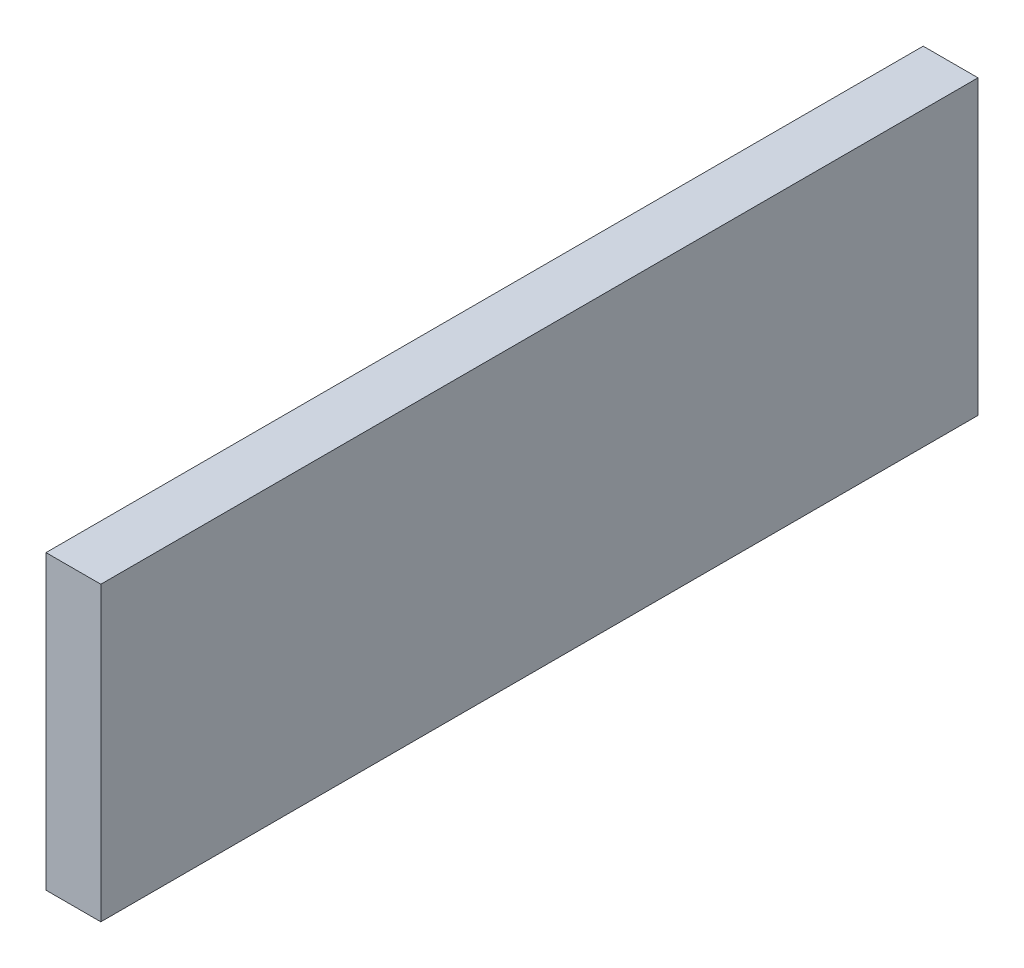
ISO-10303-21;
HEADER;
FILE_DESCRIPTION(('STEP AP214'),'2;1');
FILE_NAME('part.step','',(''),(''),'','','');
FILE_SCHEMA(('AUTOMOTIVE_DESIGN { 1 0 10303 214 1 1 1 1 }'));
ENDSEC;
DATA;
#1=APPLICATION_CONTEXT('core data for automotive mechanical design processes');
#2=APPLICATION_PROTOCOL_DEFINITION('international standard','automotive_design',2000,#1);
#3=PRODUCT_CONTEXT('',#1,'mechanical');
#4=PRODUCT('Part','Part','',(#3));
#5=PRODUCT_RELATED_PRODUCT_CATEGORY('part','',(#4));
#6=PRODUCT_DEFINITION_FORMATION('','',#4);
#7=PRODUCT_DEFINITION_CONTEXT('part definition',#1,'design');
#8=PRODUCT_DEFINITION('design','',#6,#7);
#9=PRODUCT_DEFINITION_SHAPE('','',#8);
#10=(LENGTH_UNIT() NAMED_UNIT(*) SI_UNIT(.MILLI.,.METRE.));
#11=(NAMED_UNIT(*) PLANE_ANGLE_UNIT() SI_UNIT($,.RADIAN.));
#12=(NAMED_UNIT(*) SI_UNIT($,.STERADIAN.) SOLID_ANGLE_UNIT());
#13=UNCERTAINTY_MEASURE_WITH_UNIT(LENGTH_MEASURE(1.E-05),#10,'distance_accuracy_value','');
#14=(GEOMETRIC_REPRESENTATION_CONTEXT(3) GLOBAL_UNCERTAINTY_ASSIGNED_CONTEXT((#13)) GLOBAL_UNIT_ASSIGNED_CONTEXT((#10,
#11,#12)) REPRESENTATION_CONTEXT('',''));
#15=CARTESIAN_POINT('',(0.,0.,0.));
#16=DIRECTION('',(0.,0.,1.));
#17=DIRECTION('',(1.,0.,0.));
#18=AXIS2_PLACEMENT_3D('',#15,#16,#17);
#19=CARTESIAN_POINT('',(9.525,-50.8,-152.4));
#20=DIRECTION('',(0.,0.,1.));
#21=DIRECTION('',(1.,0.,0.));
#22=AXIS2_PLACEMENT_3D('',#19,#20,#21);
#23=PLANE('',#22);
#24=DIRECTION('',(0.,1.,0.));
#25=VECTOR('',#24,1.);
#26=CARTESIAN_POINT('',(-9.525,-50.8,-152.4));
#27=LINE('',#26,#25);
#28=CARTESIAN_POINT('',(-9.525,-50.8,-152.4));
#29=VERTEX_POINT('',#28);
#30=CARTESIAN_POINT('',(-9.525,50.8,-152.4));
#31=VERTEX_POINT('',#30);
#32=EDGE_CURVE('E102',#29,#31,#27,.T.);
#33=ORIENTED_EDGE('',*,*,#32,.T.);
#34=DIRECTION('',(-1.,0.,0.));
#35=VECTOR('',#34,1.);
#36=CARTESIAN_POINT('',(9.525,50.8,-152.4));
#37=LINE('',#36,#35);
#38=CARTESIAN_POINT('',(9.525,50.8,-152.4));
#39=VERTEX_POINT('',#38);
#40=EDGE_CURVE('E11',#39,#31,#37,.T.);
#41=ORIENTED_EDGE('',*,*,#40,.F.);
#42=DIRECTION('',(0.,1.,0.));
#43=VECTOR('',#42,1.);
#44=CARTESIAN_POINT('',(9.525,-50.8,-152.4));
#45=LINE('',#44,#43);
#46=CARTESIAN_POINT('',(9.525,-50.8,-152.4));
#47=VERTEX_POINT('',#46);
#48=EDGE_CURVE('E90',#47,#39,#45,.T.);
#49=ORIENTED_EDGE('',*,*,#48,.F.);
#50=DIRECTION('',(-1.,0.,0.));
#51=VECTOR('',#50,1.);
#52=CARTESIAN_POINT('',(9.525,-50.8,-152.4));
#53=LINE('',#52,#51);
#54=EDGE_CURVE('E98',#47,#29,#53,.T.);
#55=ORIENTED_EDGE('',*,*,#54,.T.);
#56=EDGE_LOOP('',(#33,#41,#49,#55));
#57=FACE_BOUND('',#56,.T.);
#58=ADVANCED_FACE('F39',(#57),#23,.F.);
#59=CARTESIAN_POINT('',(9.525,50.8,152.4));
#60=DIRECTION('',(0.,-1.,0.));
#61=DIRECTION('',(0.,0.,-1.));
#62=AXIS2_PLACEMENT_3D('',#59,#60,#61);
#63=PLANE('',#62);
#64=DIRECTION('',(0.,0.,1.));
#65=VECTOR('',#64,1.);
#66=CARTESIAN_POINT('',(-9.525,50.8,152.4));
#67=LINE('',#66,#65);
#68=CARTESIAN_POINT('',(-9.525,50.8,152.4));
#69=VERTEX_POINT('',#68);
#70=EDGE_CURVE('E94',#31,#69,#67,.T.);
#71=ORIENTED_EDGE('',*,*,#70,.T.);
#72=DIRECTION('',(-1.,0.,0.));
#73=VECTOR('',#72,1.);
#74=CARTESIAN_POINT('',(9.525,50.8,152.4));
#75=LINE('',#74,#73);
#76=CARTESIAN_POINT('',(9.525,50.8,152.4));
#77=VERTEX_POINT('',#76);
#78=EDGE_CURVE('E47',#77,#69,#75,.T.);
#79=ORIENTED_EDGE('',*,*,#78,.F.);
#80=DIRECTION('',(0.,0.,1.));
#81=VECTOR('',#80,1.);
#82=CARTESIAN_POINT('',(9.525,50.8,152.4));
#83=LINE('',#82,#81);
#84=EDGE_CURVE('E85',#39,#77,#83,.T.);
#85=ORIENTED_EDGE('',*,*,#84,.F.);
#86=ORIENTED_EDGE('',*,*,#40,.T.);
#87=EDGE_LOOP('',(#71,#79,#85,#86));
#88=FACE_BOUND('',#87,.T.);
#89=ADVANCED_FACE('F93',(#88),#63,.F.);
#90=CARTESIAN_POINT('',(9.525,-50.8,152.4));
#91=DIRECTION('',(0.,0.,-1.));
#92=DIRECTION('',(-1.,0.,0.));
#93=AXIS2_PLACEMENT_3D('',#90,#91,#92);
#94=PLANE('',#93);
#95=DIRECTION('',(0.,-1.,0.));
#96=VECTOR('',#95,1.);
#97=CARTESIAN_POINT('',(-9.525,-50.8,152.4));
#98=LINE('',#97,#96);
#99=CARTESIAN_POINT('',(-9.525,-50.8,152.4));
#100=VERTEX_POINT('',#99);
#101=EDGE_CURVE('E72',#69,#100,#98,.T.);
#102=ORIENTED_EDGE('',*,*,#101,.T.);
#103=DIRECTION('',(-1.,0.,0.));
#104=VECTOR('',#103,1.);
#105=CARTESIAN_POINT('',(9.525,-50.8,152.4));
#106=LINE('',#105,#104);
#107=CARTESIAN_POINT('',(9.525,-50.8,152.4));
#108=VERTEX_POINT('',#107);
#109=EDGE_CURVE('E95',#108,#100,#106,.T.);
#110=ORIENTED_EDGE('',*,*,#109,.F.);
#111=DIRECTION('',(0.,-1.,0.));
#112=VECTOR('',#111,1.);
#113=CARTESIAN_POINT('',(9.525,-50.8,152.4));
#114=LINE('',#113,#112);
#115=EDGE_CURVE('E88',#77,#108,#114,.T.);
#116=ORIENTED_EDGE('',*,*,#115,.F.);
#117=ORIENTED_EDGE('',*,*,#78,.T.);
#118=EDGE_LOOP('',(#102,#110,#116,#117));
#119=FACE_BOUND('',#118,.T.);
#120=ADVANCED_FACE('F96',(#119),#94,.F.);
#121=CARTESIAN_POINT('',(9.525,-50.8,152.4));
#122=DIRECTION('',(0.,1.,0.));
#123=DIRECTION('',(0.,0.,1.));
#124=AXIS2_PLACEMENT_3D('',#121,#122,#123);
#125=PLANE('',#124);
#126=DIRECTION('',(0.,0.,-1.));
#127=VECTOR('',#126,1.);
#128=CARTESIAN_POINT('',(-9.525,-50.8,152.4));
#129=LINE('',#128,#127);
#130=EDGE_CURVE('E78',#100,#29,#129,.T.);
#131=ORIENTED_EDGE('',*,*,#130,.T.);
#132=ORIENTED_EDGE('',*,*,#54,.F.);
#133=DIRECTION('',(0.,0.,-1.));
#134=VECTOR('',#133,1.);
#135=CARTESIAN_POINT('',(9.525,-50.8,152.4));
#136=LINE('',#135,#134);
#137=EDGE_CURVE('E55',#108,#47,#136,.T.);
#138=ORIENTED_EDGE('',*,*,#137,.F.);
#139=ORIENTED_EDGE('',*,*,#109,.T.);
#140=EDGE_LOOP('',(#131,#132,#138,#139));
#141=FACE_BOUND('',#140,.T.);
#142=ADVANCED_FACE('F109',(#141),#125,.F.);
#143=CARTESIAN_POINT('',(9.525,0.,0.));
#144=DIRECTION('',(-1.,0.,0.));
#145=DIRECTION('',(0.,0.,1.));
#146=AXIS2_PLACEMENT_3D('',#143,#144,#145);
#147=PLANE('',#146);
#148=ORIENTED_EDGE('',*,*,#48,.T.);
#149=ORIENTED_EDGE('',*,*,#84,.T.);
#150=ORIENTED_EDGE('',*,*,#115,.T.);
#151=ORIENTED_EDGE('',*,*,#137,.T.);
#152=EDGE_LOOP('',(#148,#149,#150,#151));
#153=FACE_BOUND('',#152,.T.);
#154=ADVANCED_FACE('F86',(#153),#147,.F.);
#155=CARTESIAN_POINT('',(-9.525,0.,0.));
#156=DIRECTION('',(-1.,0.,0.));
#157=DIRECTION('',(0.,0.,1.));
#158=AXIS2_PLACEMENT_3D('',#155,#156,#157);
#159=PLANE('',#158);
#160=ORIENTED_EDGE('',*,*,#32,.F.);
#161=ORIENTED_EDGE('',*,*,#130,.F.);
#162=ORIENTED_EDGE('',*,*,#101,.F.);
#163=ORIENTED_EDGE('',*,*,#70,.F.);
#164=EDGE_LOOP('',(#160,#161,#162,#163));
#165=FACE_BOUND('',#164,.T.);
#166=ADVANCED_FACE('F112',(#165),#159,.T.);
#167=CLOSED_SHELL('',(#58,#89,#120,#142,#154,#166));
#168=MANIFOLD_SOLID_BREP('B2',#167);
#169=ADVANCED_BREP_SHAPE_REPRESENTATION('',(#18,#168),#14);
#170=SHAPE_DEFINITION_REPRESENTATION(#9,#169);
ENDSEC;
END-ISO-10303-21;
